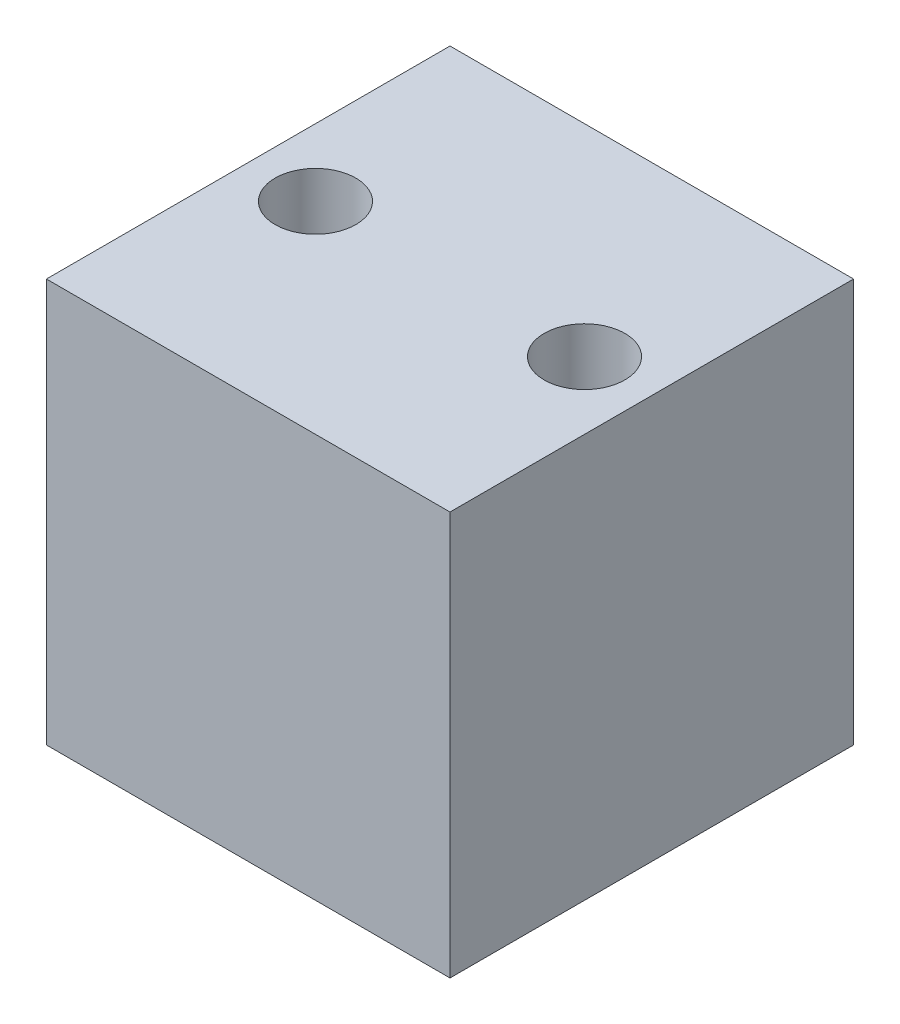
ISO-10303-21;
HEADER;
FILE_DESCRIPTION(('STEP AP214'),'2;1');
FILE_NAME('part.step','',(''),(''),'','','');
FILE_SCHEMA(('AUTOMOTIVE_DESIGN { 1 0 10303 214 1 1 1 1 }'));
ENDSEC;
DATA;
#1=APPLICATION_CONTEXT('core data for automotive mechanical design processes');
#2=APPLICATION_PROTOCOL_DEFINITION('international standard','automotive_design',2000,#1);
#3=PRODUCT_CONTEXT('',#1,'mechanical');
#4=PRODUCT('Part','Part','',(#3));
#5=PRODUCT_RELATED_PRODUCT_CATEGORY('part','',(#4));
#6=PRODUCT_DEFINITION_FORMATION('','',#4);
#7=PRODUCT_DEFINITION_CONTEXT('part definition',#1,'design');
#8=PRODUCT_DEFINITION('design','',#6,#7);
#9=PRODUCT_DEFINITION_SHAPE('','',#8);
#10=(LENGTH_UNIT() NAMED_UNIT(*) SI_UNIT(.MILLI.,.METRE.));
#11=(NAMED_UNIT(*) PLANE_ANGLE_UNIT() SI_UNIT($,.RADIAN.));
#12=(NAMED_UNIT(*) SI_UNIT($,.STERADIAN.) SOLID_ANGLE_UNIT());
#13=UNCERTAINTY_MEASURE_WITH_UNIT(LENGTH_MEASURE(1.E-05),#10,'distance_accuracy_value','');
#14=(GEOMETRIC_REPRESENTATION_CONTEXT(3) GLOBAL_UNCERTAINTY_ASSIGNED_CONTEXT((#13)) GLOBAL_UNIT_ASSIGNED_CONTEXT((#10,
#11,#12)) REPRESENTATION_CONTEXT('',''));
#15=CARTESIAN_POINT('',(0.,0.,0.));
#16=DIRECTION('',(0.,0.,1.));
#17=DIRECTION('',(1.,0.,0.));
#18=AXIS2_PLACEMENT_3D('',#15,#16,#17);
#19=CARTESIAN_POINT('',(0.,38.1,0.));
#20=DIRECTION('',(0.,1.,0.));
#21=DIRECTION('',(0.,0.,1.));
#22=AXIS2_PLACEMENT_3D('',#19,#20,#21);
#23=PLANE('',#22);
#24=CARTESIAN_POINT('',(-31.75,38.1,-19.05));
#25=DIRECTION('',(0.,1.,0.));
#26=DIRECTION('',(0.,0.,1.));
#27=AXIS2_PLACEMENT_3D('',#24,#25,#26);
#28=CIRCLE('',#27,3.81000000000001);
#29=CARTESIAN_POINT('',(-31.75,38.1,-15.24));
#30=VERTEX_POINT('',#29);
#31=EDGE_CURVE('E112',#30,#30,#28,.T.);
#32=ORIENTED_EDGE('',*,*,#31,.F.);
#33=EDGE_LOOP('',(#32));
#34=FACE_BOUND('',#33,.T.);
#35=DIRECTION('',(0.,0.,1.));
#36=VECTOR('',#35,1.);
#37=CARTESIAN_POINT('',(-38.1,38.1,-38.1));
#38=LINE('',#37,#36);
#39=CARTESIAN_POINT('',(-38.1,38.1,-38.1));
#40=VERTEX_POINT('',#39);
#41=CARTESIAN_POINT('',(-38.1,38.1,0.));
#42=VERTEX_POINT('',#41);
#43=EDGE_CURVE('E92',#40,#42,#38,.T.);
#44=ORIENTED_EDGE('',*,*,#43,.T.);
#45=DIRECTION('',(1.,0.,0.));
#46=VECTOR('',#45,1.);
#47=CARTESIAN_POINT('',(-38.1,38.1,0.));
#48=LINE('',#47,#46);
#49=CARTESIAN_POINT('',(0.,38.1,0.));
#50=VERTEX_POINT('',#49);
#51=EDGE_CURVE('E87',#42,#50,#48,.T.);
#52=ORIENTED_EDGE('',*,*,#51,.T.);
#53=DIRECTION('',(0.,0.,-1.));
#54=VECTOR('',#53,1.);
#55=CARTESIAN_POINT('',(0.,38.1,-38.1));
#56=LINE('',#55,#54);
#57=CARTESIAN_POINT('',(0.,38.1,-38.1));
#58=VERTEX_POINT('',#57);
#59=EDGE_CURVE('E90',#50,#58,#56,.T.);
#60=ORIENTED_EDGE('',*,*,#59,.T.);
#61=DIRECTION('',(-1.,0.,0.));
#62=VECTOR('',#61,1.);
#63=CARTESIAN_POINT('',(-38.1,38.1,-38.1));
#64=LINE('',#63,#62);
#65=EDGE_CURVE('E57',#58,#40,#64,.T.);
#66=ORIENTED_EDGE('',*,*,#65,.T.);
#67=EDGE_LOOP('',(#44,#52,#60,#66));
#68=FACE_BOUND('',#67,.T.);
#69=CARTESIAN_POINT('',(-6.35,38.1,-19.05));
#70=DIRECTION('',(0.,1.,0.));
#71=DIRECTION('',(0.,0.,1.));
#72=AXIS2_PLACEMENT_3D('',#69,#70,#71);
#73=CIRCLE('',#72,3.81);
#74=CARTESIAN_POINT('',(-6.35,38.1,-15.24));
#75=VERTEX_POINT('',#74);
#76=EDGE_CURVE('E134',#75,#75,#73,.T.);
#77=ORIENTED_EDGE('',*,*,#76,.F.);
#78=EDGE_LOOP('',(#77));
#79=FACE_BOUND('',#78,.T.);
#80=ADVANCED_FACE('F39',(#34,#68,#79),#23,.T.);
#81=CARTESIAN_POINT('',(0.,0.,0.));
#82=DIRECTION('',(0.,1.,0.));
#83=DIRECTION('',(0.,0.,1.));
#84=AXIS2_PLACEMENT_3D('',#81,#82,#83);
#85=PLANE('',#84);
#86=DIRECTION('',(0.,0.,1.));
#87=VECTOR('',#86,1.);
#88=CARTESIAN_POINT('',(-38.1,0.,-38.1));
#89=LINE('',#88,#87);
#90=CARTESIAN_POINT('',(-38.1,0.,-38.1));
#91=VERTEX_POINT('',#90);
#92=CARTESIAN_POINT('',(-38.1,0.,0.));
#93=VERTEX_POINT('',#92);
#94=EDGE_CURVE('E108',#91,#93,#89,.T.);
#95=ORIENTED_EDGE('',*,*,#94,.F.);
#96=DIRECTION('',(-1.,0.,0.));
#97=VECTOR('',#96,1.);
#98=CARTESIAN_POINT('',(-38.1,0.,-38.1));
#99=LINE('',#98,#97);
#100=CARTESIAN_POINT('',(0.,0.,-38.1));
#101=VERTEX_POINT('',#100);
#102=EDGE_CURVE('E80',#101,#91,#99,.T.);
#103=ORIENTED_EDGE('',*,*,#102,.F.);
#104=DIRECTION('',(0.,0.,-1.));
#105=VECTOR('',#104,1.);
#106=CARTESIAN_POINT('',(0.,0.,-38.1));
#107=LINE('',#106,#105);
#108=CARTESIAN_POINT('',(0.,0.,0.));
#109=VERTEX_POINT('',#108);
#110=EDGE_CURVE('E74',#109,#101,#107,.T.);
#111=ORIENTED_EDGE('',*,*,#110,.F.);
#112=DIRECTION('',(1.,0.,0.));
#113=VECTOR('',#112,1.);
#114=CARTESIAN_POINT('',(-38.1,0.,0.));
#115=LINE('',#114,#113);
#116=EDGE_CURVE('E97',#93,#109,#115,.T.);
#117=ORIENTED_EDGE('',*,*,#116,.F.);
#118=EDGE_LOOP('',(#95,#103,#111,#117));
#119=FACE_BOUND('',#118,.T.);
#120=CARTESIAN_POINT('',(-31.75,0.,-19.05));
#121=DIRECTION('',(0.,1.,0.));
#122=DIRECTION('',(0.,0.,1.));
#123=AXIS2_PLACEMENT_3D('',#120,#121,#122);
#124=CIRCLE('',#123,3.81000000000001);
#125=CARTESIAN_POINT('',(-31.75,0.,-15.24));
#126=VERTEX_POINT('',#125);
#127=EDGE_CURVE('E130',#126,#126,#124,.T.);
#128=ORIENTED_EDGE('',*,*,#127,.T.);
#129=EDGE_LOOP('',(#128));
#130=FACE_BOUND('',#129,.T.);
#131=CARTESIAN_POINT('',(-6.35,0.,-19.05));
#132=DIRECTION('',(0.,1.,0.));
#133=DIRECTION('',(0.,0.,1.));
#134=AXIS2_PLACEMENT_3D('',#131,#132,#133);
#135=CIRCLE('',#134,3.81);
#136=CARTESIAN_POINT('',(-6.35,0.,-15.24));
#137=VERTEX_POINT('',#136);
#138=EDGE_CURVE('E138',#137,#137,#135,.T.);
#139=ORIENTED_EDGE('',*,*,#138,.T.);
#140=EDGE_LOOP('',(#139));
#141=FACE_BOUND('',#140,.T.);
#142=ADVANCED_FACE('F125',(#119,#130,#141),#85,.F.);
#143=CARTESIAN_POINT('',(-38.1,38.1,-38.1));
#144=DIRECTION('',(1.,0.,0.));
#145=DIRECTION('',(0.,0.,-1.));
#146=AXIS2_PLACEMENT_3D('',#143,#144,#145);
#147=PLANE('',#146);
#148=ORIENTED_EDGE('',*,*,#94,.T.);
#149=DIRECTION('',(0.,-1.,0.));
#150=VECTOR('',#149,1.);
#151=CARTESIAN_POINT('',(-38.1,38.1,0.));
#152=LINE('',#151,#150);
#153=EDGE_CURVE('E11',#42,#93,#152,.T.);
#154=ORIENTED_EDGE('',*,*,#153,.F.);
#155=ORIENTED_EDGE('',*,*,#43,.F.);
#156=DIRECTION('',(0.,-1.,0.));
#157=VECTOR('',#156,1.);
#158=CARTESIAN_POINT('',(-38.1,38.1,-38.1));
#159=LINE('',#158,#157);
#160=EDGE_CURVE('E104',#40,#91,#159,.T.);
#161=ORIENTED_EDGE('',*,*,#160,.T.);
#162=EDGE_LOOP('',(#148,#154,#155,#161));
#163=FACE_BOUND('',#162,.T.);
#164=ADVANCED_FACE('F41',(#163),#147,.F.);
#165=CARTESIAN_POINT('',(-38.1,38.1,0.));
#166=DIRECTION('',(0.,0.,-1.));
#167=DIRECTION('',(-1.,0.,0.));
#168=AXIS2_PLACEMENT_3D('',#165,#166,#167);
#169=PLANE('',#168);
#170=ORIENTED_EDGE('',*,*,#116,.T.);
#171=DIRECTION('',(0.,-1.,0.));
#172=VECTOR('',#171,1.);
#173=CARTESIAN_POINT('',(0.,38.1,0.));
#174=LINE('',#173,#172);
#175=EDGE_CURVE('E49',#50,#109,#174,.T.);
#176=ORIENTED_EDGE('',*,*,#175,.F.);
#177=ORIENTED_EDGE('',*,*,#51,.F.);
#178=ORIENTED_EDGE('',*,*,#153,.T.);
#179=EDGE_LOOP('',(#170,#176,#177,#178));
#180=FACE_BOUND('',#179,.T.);
#181=ADVANCED_FACE('F96',(#180),#169,.F.);
#182=CARTESIAN_POINT('',(0.,38.1,-38.1));
#183=DIRECTION('',(-1.,0.,0.));
#184=DIRECTION('',(0.,0.,1.));
#185=AXIS2_PLACEMENT_3D('',#182,#183,#184);
#186=PLANE('',#185);
#187=ORIENTED_EDGE('',*,*,#110,.T.);
#188=DIRECTION('',(0.,-1.,0.));
#189=VECTOR('',#188,1.);
#190=CARTESIAN_POINT('',(0.,38.1,-38.1));
#191=LINE('',#190,#189);
#192=EDGE_CURVE('E99',#58,#101,#191,.T.);
#193=ORIENTED_EDGE('',*,*,#192,.F.);
#194=ORIENTED_EDGE('',*,*,#59,.F.);
#195=ORIENTED_EDGE('',*,*,#175,.T.);
#196=EDGE_LOOP('',(#187,#193,#194,#195));
#197=FACE_BOUND('',#196,.T.);
#198=ADVANCED_FACE('F100',(#197),#186,.F.);
#199=CARTESIAN_POINT('',(-38.1,38.1,-38.1));
#200=DIRECTION('',(0.,0.,1.));
#201=DIRECTION('',(1.,0.,0.));
#202=AXIS2_PLACEMENT_3D('',#199,#200,#201);
#203=PLANE('',#202);
#204=ORIENTED_EDGE('',*,*,#102,.T.);
#205=ORIENTED_EDGE('',*,*,#160,.F.);
#206=ORIENTED_EDGE('',*,*,#65,.F.);
#207=ORIENTED_EDGE('',*,*,#192,.T.);
#208=EDGE_LOOP('',(#204,#205,#206,#207));
#209=FACE_BOUND('',#208,.T.);
#210=ADVANCED_FACE('F122',(#209),#203,.F.);
#211=CARTESIAN_POINT('',(-31.75,38.1,-19.05));
#212=DIRECTION('',(0.,-1.,0.));
#213=DIRECTION('',(0.,0.,-1.));
#214=AXIS2_PLACEMENT_3D('',#211,#212,#213);
#215=CYLINDRICAL_SURFACE('',#214,3.81000000000001);
#216=ORIENTED_EDGE('',*,*,#31,.T.);
#217=EDGE_LOOP('',(#216));
#218=FACE_BOUND('',#217,.T.);
#219=ORIENTED_EDGE('',*,*,#127,.F.);
#220=EDGE_LOOP('',(#219));
#221=FACE_BOUND('',#220,.T.);
#222=ADVANCED_FACE('F157',(#218,#221),#215,.F.);
#223=CARTESIAN_POINT('',(-6.35,38.1,-19.05));
#224=DIRECTION('',(0.,-1.,0.));
#225=DIRECTION('',(0.,0.,-1.));
#226=AXIS2_PLACEMENT_3D('',#223,#224,#225);
#227=CYLINDRICAL_SURFACE('',#226,3.81);
#228=ORIENTED_EDGE('',*,*,#76,.T.);
#229=EDGE_LOOP('',(#228));
#230=FACE_BOUND('',#229,.T.);
#231=ORIENTED_EDGE('',*,*,#138,.F.);
#232=EDGE_LOOP('',(#231));
#233=FACE_BOUND('',#232,.T.);
#234=ADVANCED_FACE('F146',(#230,#233),#227,.F.);
#235=CLOSED_SHELL('',(#80,#142,#164,#181,#198,#210,#222,#234));
#236=MANIFOLD_SOLID_BREP('B2',#235);
#237=ADVANCED_BREP_SHAPE_REPRESENTATION('',(#18,#236),#14);
#238=SHAPE_DEFINITION_REPRESENTATION(#9,#237);
ENDSEC;
END-ISO-10303-21;
